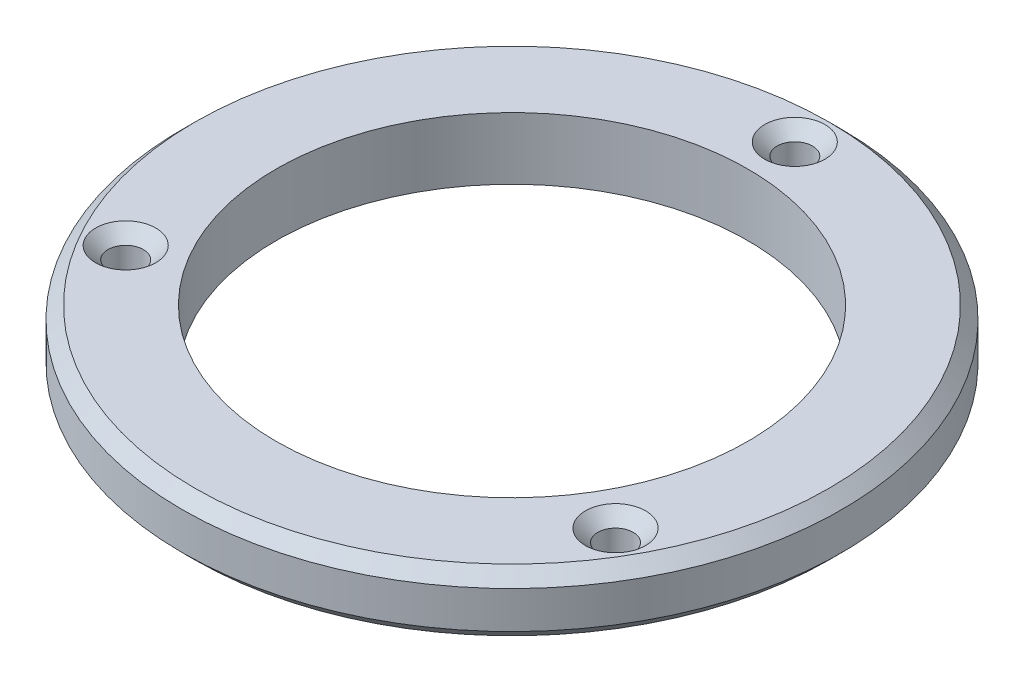
ISO-10303-21;
HEADER;
FILE_DESCRIPTION(('STEP AP214'),'2;1');
FILE_NAME('part.step','',(''),(''),'','','');
FILE_SCHEMA(('AUTOMOTIVE_DESIGN { 1 0 10303 214 1 1 1 1 }'));
ENDSEC;
DATA;
#1=APPLICATION_CONTEXT('core data for automotive mechanical design processes');
#2=APPLICATION_PROTOCOL_DEFINITION('international standard','automotive_design',2000,#1);
#3=PRODUCT_CONTEXT('',#1,'mechanical');
#4=PRODUCT('Part','Part','',(#3));
#5=PRODUCT_RELATED_PRODUCT_CATEGORY('part','',(#4));
#6=PRODUCT_DEFINITION_FORMATION('','',#4);
#7=PRODUCT_DEFINITION_CONTEXT('part definition',#1,'design');
#8=PRODUCT_DEFINITION('design','',#6,#7);
#9=PRODUCT_DEFINITION_SHAPE('','',#8);
#10=(LENGTH_UNIT() NAMED_UNIT(*) SI_UNIT(.MILLI.,.METRE.));
#11=(NAMED_UNIT(*) PLANE_ANGLE_UNIT() SI_UNIT($,.RADIAN.));
#12=(NAMED_UNIT(*) SI_UNIT($,.STERADIAN.) SOLID_ANGLE_UNIT());
#13=UNCERTAINTY_MEASURE_WITH_UNIT(LENGTH_MEASURE(1.E-05),#10,'distance_accuracy_value','');
#14=(GEOMETRIC_REPRESENTATION_CONTEXT(3) GLOBAL_UNCERTAINTY_ASSIGNED_CONTEXT((#13)) GLOBAL_UNIT_ASSIGNED_CONTEXT((#10,
#11,#12)) REPRESENTATION_CONTEXT('',''));
#15=CARTESIAN_POINT('',(0.,0.,0.));
#16=DIRECTION('',(0.,0.,1.));
#17=DIRECTION('',(1.,0.,0.));
#18=AXIS2_PLACEMENT_3D('',#15,#16,#17);
#19=CARTESIAN_POINT('',(0.,5.,0.));
#20=DIRECTION('',(0.,1.,0.));
#21=DIRECTION('',(0.,0.,1.));
#22=AXIS2_PLACEMENT_3D('',#19,#20,#21);
#23=PLANE('',#22);
#24=CARTESIAN_POINT('',(0.,5.,0.));
#25=DIRECTION('',(0.,1.,0.));
#26=DIRECTION('',(0.,0.,1.));
#27=AXIS2_PLACEMENT_3D('',#24,#25,#26);
#28=CIRCLE('',#27,25.543);
#29=CARTESIAN_POINT('',(0.,5.,25.543));
#30=VERTEX_POINT('',#29);
#31=EDGE_CURVE('E48',#30,#30,#28,.T.);
#32=ORIENTED_EDGE('',*,*,#31,.T.);
#33=EDGE_LOOP('',(#32));
#34=FACE_BOUND('',#33,.T.);
#35=CARTESIAN_POINT('',(19.7252223806248,5.,11.3883624512791));
#36=DIRECTION('',(0.,1.,0.));
#37=DIRECTION('',(0.,0.,1.));
#38=AXIS2_PLACEMENT_3D('',#35,#36,#37);
#39=CIRCLE('',#38,2.42500000000001);
#40=CARTESIAN_POINT('',(19.7252223806248,5.,13.8133624512791));
#41=VERTEX_POINT('',#40);
#42=EDGE_CURVE('E53',#41,#41,#39,.F.);
#43=ORIENTED_EDGE('',*,*,#42,.T.);
#44=EDGE_LOOP('',(#43));
#45=FACE_BOUND('',#44,.T.);
#46=CARTESIAN_POINT('',(-19.7252223806235,5.,11.3883624512781));
#47=DIRECTION('',(0.,1.,0.));
#48=DIRECTION('',(0.,0.,1.));
#49=AXIS2_PLACEMENT_3D('',#46,#47,#48);
#50=CIRCLE('',#49,2.42500000000059);
#51=CARTESIAN_POINT('',(-19.7252223806235,5.,13.8133624512787));
#52=VERTEX_POINT('',#51);
#53=EDGE_CURVE('E59',#52,#52,#50,.F.);
#54=ORIENTED_EDGE('',*,*,#53,.T.);
#55=EDGE_LOOP('',(#54));
#56=FACE_BOUND('',#55,.T.);
#57=CARTESIAN_POINT('',(1.57551628838764E-12,5.,-22.7767249025572));
#58=DIRECTION('',(0.,1.,0.));
#59=DIRECTION('',(0.,0.,1.));
#60=AXIS2_PLACEMENT_3D('',#57,#58,#59);
#61=CIRCLE('',#60,2.42499999999875);
#62=CARTESIAN_POINT('',(1.57551628838764E-12,5.,-20.3517249025584));
#63=VERTEX_POINT('',#62);
#64=EDGE_CURVE('E65',#63,#63,#61,.F.);
#65=ORIENTED_EDGE('',*,*,#64,.T.);
#66=EDGE_LOOP('',(#65));
#67=FACE_BOUND('',#66,.T.);
#68=CARTESIAN_POINT('',(0.,5.,0.));
#69=DIRECTION('',(0.,1.,0.));
#70=DIRECTION('',(0.,0.,1.));
#71=AXIS2_PLACEMENT_3D('',#68,#69,#70);
#72=CIRCLE('',#71,19.);
#73=CARTESIAN_POINT('',(0.,5.,19.));
#74=VERTEX_POINT('',#73);
#75=EDGE_CURVE('E71',#74,#74,#72,.T.);
#76=ORIENTED_EDGE('',*,*,#75,.F.);
#77=EDGE_LOOP('',(#76));
#78=FACE_BOUND('',#77,.T.);
#79=ADVANCED_FACE('F33',(#34,#45,#56,#67,#78),#23,.T.);
#80=CARTESIAN_POINT('',(0.,0.,0.));
#81=DIRECTION('',(0.,1.,0.));
#82=DIRECTION('',(0.,0.,1.));
#83=AXIS2_PLACEMENT_3D('',#80,#81,#82);
#84=PLANE('',#83);
#85=CARTESIAN_POINT('',(0.,0.,0.));
#86=DIRECTION('',(0.,1.,0.));
#87=DIRECTION('',(0.,0.,1.));
#88=AXIS2_PLACEMENT_3D('',#85,#86,#87);
#89=CIRCLE('',#88,25.543);
#90=CARTESIAN_POINT('',(0.,0.,25.543));
#91=VERTEX_POINT('',#90);
#92=EDGE_CURVE('E10',#91,#91,#89,.F.);
#93=ORIENTED_EDGE('',*,*,#92,.T.);
#94=EDGE_LOOP('',(#93));
#95=FACE_BOUND('',#94,.T.);
#96=CARTESIAN_POINT('',(0.,0.,0.));
#97=DIRECTION('',(0.,1.,0.));
#98=DIRECTION('',(0.,0.,1.));
#99=AXIS2_PLACEMENT_3D('',#96,#97,#98);
#100=CIRCLE('',#99,19.);
#101=CARTESIAN_POINT('',(0.,0.,19.));
#102=VERTEX_POINT('',#101);
#103=EDGE_CURVE('E72',#102,#102,#100,.T.);
#104=ORIENTED_EDGE('',*,*,#103,.T.);
#105=EDGE_LOOP('',(#104));
#106=FACE_BOUND('',#105,.T.);
#107=CARTESIAN_POINT('',(1.57551628838764E-12,0.,-22.7767249025572));
#108=DIRECTION('',(0.,1.,0.));
#109=DIRECTION('',(0.,0.,1.));
#110=AXIS2_PLACEMENT_3D('',#107,#108,#109);
#111=CIRCLE('',#110,1.42499999999874);
#112=CARTESIAN_POINT('',(1.57551628838764E-12,0.,-21.3517249025585));
#113=VERTEX_POINT('',#112);
#114=EDGE_CURVE('E75',#113,#113,#111,.T.);
#115=ORIENTED_EDGE('',*,*,#114,.T.);
#116=EDGE_LOOP('',(#115));
#117=FACE_BOUND('',#116,.T.);
#118=CARTESIAN_POINT('',(19.7252223806248,0.,11.3883624512791));
#119=DIRECTION('',(0.,1.,0.));
#120=DIRECTION('',(0.,0.,1.));
#121=AXIS2_PLACEMENT_3D('',#118,#119,#120);
#122=CIRCLE('',#121,1.425);
#123=CARTESIAN_POINT('',(19.7252223806248,0.,12.8133624512791));
#124=VERTEX_POINT('',#123);
#125=EDGE_CURVE('E80',#124,#124,#122,.T.);
#126=ORIENTED_EDGE('',*,*,#125,.T.);
#127=EDGE_LOOP('',(#126));
#128=FACE_BOUND('',#127,.T.);
#129=CARTESIAN_POINT('',(-19.7252223806235,0.,11.3883624512781));
#130=DIRECTION('',(0.,1.,0.));
#131=DIRECTION('',(0.,0.,1.));
#132=AXIS2_PLACEMENT_3D('',#129,#130,#131);
#133=CIRCLE('',#132,1.42500000000058);
#134=CARTESIAN_POINT('',(-19.7252223806235,0.,12.8133624512787));
#135=VERTEX_POINT('',#134);
#136=EDGE_CURVE('E83',#135,#135,#133,.T.);
#137=ORIENTED_EDGE('',*,*,#136,.T.);
#138=EDGE_LOOP('',(#137));
#139=FACE_BOUND('',#138,.T.);
#140=ADVANCED_FACE('F87',(#95,#106,#117,#128,#139),#84,.F.);
#141=CARTESIAN_POINT('',(0.,5.,0.));
#142=DIRECTION('',(0.,-1.,0.));
#143=DIRECTION('',(0.,0.,-1.));
#144=AXIS2_PLACEMENT_3D('',#141,#142,#143);
#145=CYLINDRICAL_SURFACE('',#144,26.543);
#146=CARTESIAN_POINT('',(0.,1.00000000000001,0.));
#147=DIRECTION('',(0.,1.,0.));
#148=DIRECTION('',(0.,0.,1.));
#149=AXIS2_PLACEMENT_3D('',#146,#147,#148);
#150=CIRCLE('',#149,26.543);
#151=CARTESIAN_POINT('',(0.,1.00000000000001,26.543));
#152=VERTEX_POINT('',#151);
#153=EDGE_CURVE('E40',#152,#152,#150,.T.);
#154=ORIENTED_EDGE('',*,*,#153,.T.);
#155=EDGE_LOOP('',(#154));
#156=FACE_BOUND('',#155,.T.);
#157=CARTESIAN_POINT('',(0.,4.00000000000001,0.));
#158=DIRECTION('',(0.,1.,0.));
#159=DIRECTION('',(0.,0.,1.));
#160=AXIS2_PLACEMENT_3D('',#157,#158,#159);
#161=CIRCLE('',#160,26.543);
#162=CARTESIAN_POINT('',(0.,4.00000000000001,26.543));
#163=VERTEX_POINT('',#162);
#164=EDGE_CURVE('E44',#163,#163,#161,.F.);
#165=ORIENTED_EDGE('',*,*,#164,.T.);
#166=EDGE_LOOP('',(#165));
#167=FACE_BOUND('',#166,.T.);
#168=ADVANCED_FACE('F111',(#156,#167),#145,.T.);
#169=CARTESIAN_POINT('',(0.,5.,0.));
#170=DIRECTION('',(0.,-1.,0.));
#171=DIRECTION('',(0.,0.,-1.));
#172=AXIS2_PLACEMENT_3D('',#169,#170,#171);
#173=CYLINDRICAL_SURFACE('',#172,19.);
#174=ORIENTED_EDGE('',*,*,#75,.T.);
#175=EDGE_LOOP('',(#174));
#176=FACE_BOUND('',#175,.T.);
#177=ORIENTED_EDGE('',*,*,#103,.F.);
#178=EDGE_LOOP('',(#177));
#179=FACE_BOUND('',#178,.T.);
#180=ADVANCED_FACE('F115',(#176,#179),#173,.F.);
#181=CARTESIAN_POINT('',(1.57551628838764E-12,5.,-22.7767249025572));
#182=DIRECTION('',(0.,-1.,0.));
#183=DIRECTION('',(0.,0.,-1.));
#184=AXIS2_PLACEMENT_3D('',#181,#182,#183);
#185=CYLINDRICAL_SURFACE('',#184,1.42499999999874);
#186=CARTESIAN_POINT('',(1.57551628838764E-12,3.99999999999999,-22.7767249025572));
#187=DIRECTION('',(0.,1.,0.));
#188=DIRECTION('',(0.,0.,1.));
#189=AXIS2_PLACEMENT_3D('',#186,#187,#188);
#190=CIRCLE('',#189,1.42499999999874);
#191=CARTESIAN_POINT('',(1.57551628838764E-12,3.99999999999999,-21.3517249025585));
#192=VERTEX_POINT('',#191);
#193=EDGE_CURVE('E68',#192,#192,#190,.T.);
#194=ORIENTED_EDGE('',*,*,#193,.T.);
#195=EDGE_LOOP('',(#194));
#196=FACE_BOUND('',#195,.T.);
#197=ORIENTED_EDGE('',*,*,#114,.F.);
#198=EDGE_LOOP('',(#197));
#199=FACE_BOUND('',#198,.T.);
#200=ADVANCED_FACE('F102',(#196,#199),#185,.F.);
#201=CARTESIAN_POINT('',(19.7252223806248,5.,11.3883624512791));
#202=DIRECTION('',(0.,-1.,0.));
#203=DIRECTION('',(0.,0.,-1.));
#204=AXIS2_PLACEMENT_3D('',#201,#202,#203);
#205=CYLINDRICAL_SURFACE('',#204,1.425);
#206=CARTESIAN_POINT('',(19.7252223806248,4.,11.3883624512791));
#207=DIRECTION('',(0.,1.,0.));
#208=DIRECTION('',(0.,0.,1.));
#209=AXIS2_PLACEMENT_3D('',#206,#207,#208);
#210=CIRCLE('',#209,1.425);
#211=CARTESIAN_POINT('',(19.7252223806248,4.,12.8133624512791));
#212=VERTEX_POINT('',#211);
#213=EDGE_CURVE('E56',#212,#212,#210,.T.);
#214=ORIENTED_EDGE('',*,*,#213,.T.);
#215=EDGE_LOOP('',(#214));
#216=FACE_BOUND('',#215,.T.);
#217=ORIENTED_EDGE('',*,*,#125,.F.);
#218=EDGE_LOOP('',(#217));
#219=FACE_BOUND('',#218,.T.);
#220=ADVANCED_FACE('F92',(#216,#219),#205,.F.);
#221=CARTESIAN_POINT('',(-19.7252223806235,5.,11.3883624512781));
#222=DIRECTION('',(0.,-1.,0.));
#223=DIRECTION('',(0.,0.,-1.));
#224=AXIS2_PLACEMENT_3D('',#221,#222,#223);
#225=CYLINDRICAL_SURFACE('',#224,1.42500000000058);
#226=CARTESIAN_POINT('',(-19.7252223806235,3.99999999999999,11.3883624512781));
#227=DIRECTION('',(0.,1.,0.));
#228=DIRECTION('',(0.,0.,1.));
#229=AXIS2_PLACEMENT_3D('',#226,#227,#228);
#230=CIRCLE('',#229,1.42500000000058);
#231=CARTESIAN_POINT('',(-19.7252223806235,3.99999999999999,12.8133624512787));
#232=VERTEX_POINT('',#231);
#233=EDGE_CURVE('E62',#232,#232,#230,.T.);
#234=ORIENTED_EDGE('',*,*,#233,.T.);
#235=EDGE_LOOP('',(#234));
#236=FACE_BOUND('',#235,.T.);
#237=ORIENTED_EDGE('',*,*,#136,.F.);
#238=EDGE_LOOP('',(#237));
#239=FACE_BOUND('',#238,.T.);
#240=ADVANCED_FACE('F89',(#236,#239),#225,.F.);
#241=CARTESIAN_POINT('',(1.57551628838764E-12,3.99999999999999,-22.7767249025572));
#242=DIRECTION('',(0.,1.,0.));
#243=DIRECTION('',(0.,0.,1.));
#244=AXIS2_PLACEMENT_3D('',#241,#242,#243);
#245=CONICAL_SURFACE('',#244,1.42499999999874,0.785398163397453);
#246=ORIENTED_EDGE('',*,*,#64,.F.);
#247=EDGE_LOOP('',(#246));
#248=FACE_BOUND('',#247,.T.);
#249=ORIENTED_EDGE('',*,*,#193,.F.);
#250=EDGE_LOOP('',(#249));
#251=FACE_BOUND('',#250,.T.);
#252=ADVANCED_FACE('F91',(#248,#251),#245,.F.);
#253=CARTESIAN_POINT('',(-19.7252223806235,3.99999999999999,11.3883624512781));
#254=DIRECTION('',(0.,1.,0.));
#255=DIRECTION('',(0.,0.,1.));
#256=AXIS2_PLACEMENT_3D('',#253,#254,#255);
#257=CONICAL_SURFACE('',#256,1.42500000000058,0.785398163397449);
#258=ORIENTED_EDGE('',*,*,#53,.F.);
#259=EDGE_LOOP('',(#258));
#260=FACE_BOUND('',#259,.T.);
#261=ORIENTED_EDGE('',*,*,#233,.F.);
#262=EDGE_LOOP('',(#261));
#263=FACE_BOUND('',#262,.T.);
#264=ADVANCED_FACE('F99',(#260,#263),#257,.F.);
#265=CARTESIAN_POINT('',(19.7252223806248,4.,11.3883624512791));
#266=DIRECTION('',(0.,1.,0.));
#267=DIRECTION('',(0.,0.,1.));
#268=AXIS2_PLACEMENT_3D('',#265,#266,#267);
#269=CONICAL_SURFACE('',#268,1.425,0.785398163397454);
#270=ORIENTED_EDGE('',*,*,#42,.F.);
#271=EDGE_LOOP('',(#270));
#272=FACE_BOUND('',#271,.T.);
#273=ORIENTED_EDGE('',*,*,#213,.F.);
#274=EDGE_LOOP('',(#273));
#275=FACE_BOUND('',#274,.T.);
#276=ADVANCED_FACE('F122',(#272,#275),#269,.F.);
#277=CARTESIAN_POINT('',(0.,5.,0.));
#278=DIRECTION('',(0.,-1.,0.));
#279=DIRECTION('',(0.,0.,-1.));
#280=AXIS2_PLACEMENT_3D('',#277,#278,#279);
#281=CONICAL_SURFACE('',#280,25.543,0.785398163397447);
#282=ORIENTED_EDGE('',*,*,#164,.F.);
#283=EDGE_LOOP('',(#282));
#284=FACE_BOUND('',#283,.T.);
#285=ORIENTED_EDGE('',*,*,#31,.F.);
#286=EDGE_LOOP('',(#285));
#287=FACE_BOUND('',#286,.T.);
#288=ADVANCED_FACE('F125',(#284,#287),#281,.T.);
#289=CARTESIAN_POINT('',(0.,1.00000000000001,0.));
#290=DIRECTION('',(0.,1.,0.));
#291=DIRECTION('',(0.,0.,1.));
#292=AXIS2_PLACEMENT_3D('',#289,#290,#291);
#293=CONICAL_SURFACE('',#292,26.543,0.785398163397447);
#294=ORIENTED_EDGE('',*,*,#92,.F.);
#295=EDGE_LOOP('',(#294));
#296=FACE_BOUND('',#295,.T.);
#297=ORIENTED_EDGE('',*,*,#153,.F.);
#298=EDGE_LOOP('',(#297));
#299=FACE_BOUND('',#298,.T.);
#300=ADVANCED_FACE('F35',(#296,#299),#293,.T.);
#301=CLOSED_SHELL('',(#79,#140,#168,#180,#200,#220,#240,#252,#264,#276,#288,#300));
#302=MANIFOLD_SOLID_BREP('B2',#301);
#303=ADVANCED_BREP_SHAPE_REPRESENTATION('',(#18,#302),#14);
#304=SHAPE_DEFINITION_REPRESENTATION(#9,#303);
ENDSEC;
END-ISO-10303-21;
